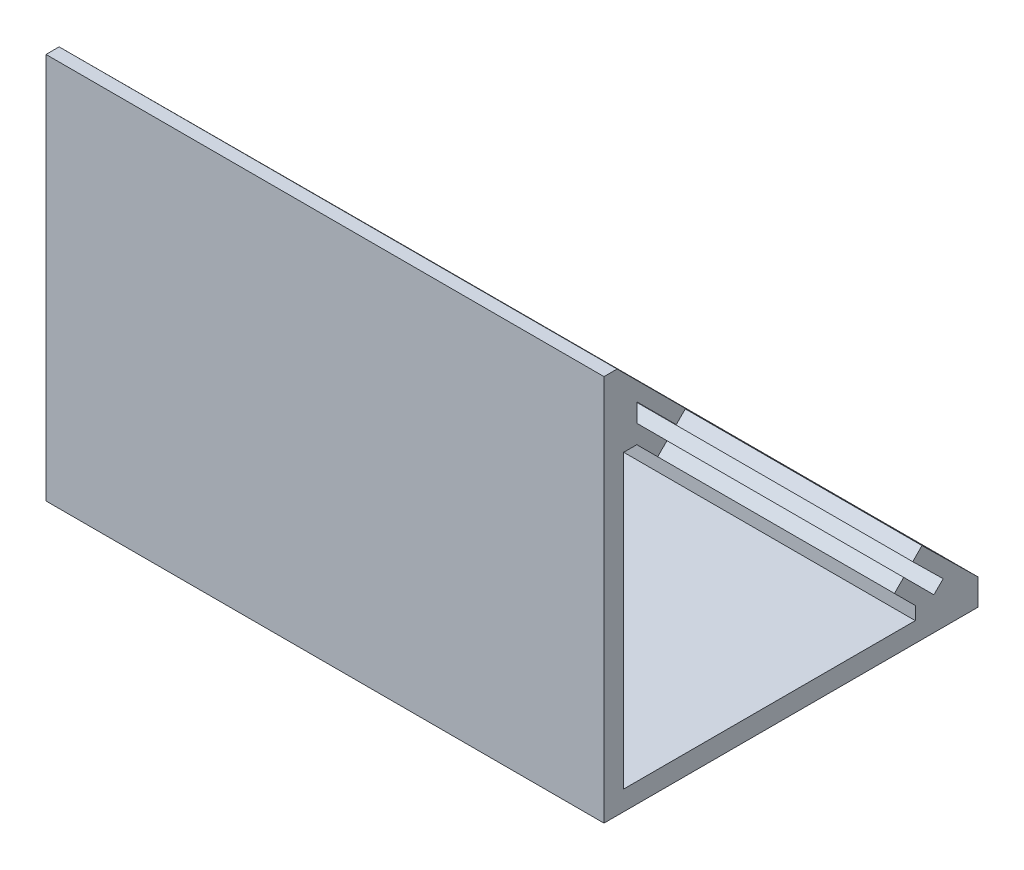
ISO-10303-21;
HEADER;
FILE_DESCRIPTION(('STEP AP214'),'2;1');
FILE_NAME('part.step','',(''),(''),'','','');
FILE_SCHEMA(('AUTOMOTIVE_DESIGN { 1 0 10303 214 1 1 1 1 }'));
ENDSEC;
DATA;
#1=APPLICATION_CONTEXT('core data for automotive mechanical design processes');
#2=APPLICATION_PROTOCOL_DEFINITION('international standard','automotive_design',2000,#1);
#3=PRODUCT_CONTEXT('',#1,'mechanical');
#4=PRODUCT('Part','Part','',(#3));
#5=PRODUCT_RELATED_PRODUCT_CATEGORY('part','',(#4));
#6=PRODUCT_DEFINITION_FORMATION('','',#4);
#7=PRODUCT_DEFINITION_CONTEXT('part definition',#1,'design');
#8=PRODUCT_DEFINITION('design','',#6,#7);
#9=PRODUCT_DEFINITION_SHAPE('','',#8);
#10=(LENGTH_UNIT() NAMED_UNIT(*) SI_UNIT(.MILLI.,.METRE.));
#11=(NAMED_UNIT(*) PLANE_ANGLE_UNIT() SI_UNIT($,.RADIAN.));
#12=(NAMED_UNIT(*) SI_UNIT($,.STERADIAN.) SOLID_ANGLE_UNIT());
#13=UNCERTAINTY_MEASURE_WITH_UNIT(LENGTH_MEASURE(1.E-05),#10,'distance_accuracy_value','');
#14=(GEOMETRIC_REPRESENTATION_CONTEXT(3) GLOBAL_UNCERTAINTY_ASSIGNED_CONTEXT((#13)) GLOBAL_UNIT_ASSIGNED_CONTEXT((#10,
#11,#12)) REPRESENTATION_CONTEXT('',''));
#15=CARTESIAN_POINT('',(0.,0.,0.));
#16=DIRECTION('',(0.,0.,1.));
#17=DIRECTION('',(1.,0.,0.));
#18=AXIS2_PLACEMENT_3D('',#15,#16,#17);
#19=CARTESIAN_POINT('',(-82.,45.2548339959385,0.));
#20=DIRECTION('',(0.,0.707106781186556,-0.707106781186539));
#21=DIRECTION('',(0.,0.707106781186539,0.707106781186556));
#22=AXIS2_PLACEMENT_3D('',#19,#20,#21);
#23=PLANE('',#22);
#24=DIRECTION('',(1.,0.,0.));
#25=VECTOR('',#24,1.);
#26=CARTESIAN_POINT('',(-82.,4.5961940777125,-40.658639918227));
#27=LINE('',#26,#25);
#28=CARTESIAN_POINT('',(-82.,4.5961940777125,-40.658639918227));
#29=VERTEX_POINT('',#28);
#30=CARTESIAN_POINT('',(0.,4.5961940777125,-40.658639918227));
#31=VERTEX_POINT('',#30);
#32=EDGE_CURVE('E465',#29,#31,#27,.T.);
#33=ORIENTED_EDGE('',*,*,#32,.T.);
#34=DIRECTION('',(0.,0.707106781186539,0.707106781186556));
#35=VECTOR('',#34,1.);
#36=CARTESIAN_POINT('',(0.,45.2548339959385,0.));
#37=LINE('',#36,#35);
#38=CARTESIAN_POINT('',(0.,0.,-45.2548339959396));
#39=VERTEX_POINT('',#38);
#40=EDGE_CURVE('E477',#39,#31,#37,.T.);
#41=ORIENTED_EDGE('',*,*,#40,.F.);
#42=DIRECTION('',(1.,0.,0.));
#43=VECTOR('',#42,1.);
#44=CARTESIAN_POINT('',(-82.,0.,-45.2548339959396));
#45=LINE('',#44,#43);
#46=CARTESIAN_POINT('',(-82.,0.,-45.2548339959396));
#47=VERTEX_POINT('',#46);
#48=EDGE_CURVE('E49',#47,#39,#45,.T.);
#49=ORIENTED_EDGE('',*,*,#48,.F.);
#50=DIRECTION('',(0.,0.707106781186539,0.707106781186556));
#51=VECTOR('',#50,1.);
#52=CARTESIAN_POINT('',(-82.,45.2548339959385,0.));
#53=LINE('',#52,#51);
#54=EDGE_CURVE('E472',#47,#29,#53,.T.);
#55=ORIENTED_EDGE('',*,*,#54,.T.);
#56=EDGE_LOOP('',(#33,#41,#49,#55));
#57=FACE_BOUND('',#56,.T.);
#58=ADVANCED_FACE('F39',(#57),#23,.T.);
#59=DIRECTION('',(1.,0.,0.));
#60=VECTOR('',#59,1.);
#61=CARTESIAN_POINT('',(-82.,40.658639918226,-4.59619407771263));
#62=LINE('',#61,#60);
#63=CARTESIAN_POINT('',(-82.,40.658639918226,-4.59619407771263));
#64=VERTEX_POINT('',#63);
#65=CARTESIAN_POINT('',(0.,40.658639918226,-4.59619407771263));
#66=VERTEX_POINT('',#65);
#67=EDGE_CURVE('E464',#64,#66,#62,.T.);
#68=ORIENTED_EDGE('',*,*,#67,.F.);
#69=CARTESIAN_POINT('',(-82.,45.2548339959385,0.));
#70=VERTEX_POINT('',#69);
#71=EDGE_CURVE('E476',#64,#70,#53,.T.);
#72=ORIENTED_EDGE('',*,*,#71,.T.);
#73=DIRECTION('',(1.,0.,0.));
#74=VECTOR('',#73,1.);
#75=CARTESIAN_POINT('',(-82.,45.2548339959385,0.));
#76=LINE('',#75,#74);
#77=CARTESIAN_POINT('',(0.,45.2548339959385,0.));
#78=VERTEX_POINT('',#77);
#79=EDGE_CURVE('E11',#70,#78,#76,.T.);
#80=ORIENTED_EDGE('',*,*,#79,.T.);
#81=EDGE_CURVE('E469',#66,#78,#37,.T.);
#82=ORIENTED_EDGE('',*,*,#81,.F.);
#83=EDGE_LOOP('',(#68,#72,#80,#82));
#84=FACE_BOUND('',#83,.T.);
#85=ADVANCED_FACE('F41',(#84),#23,.T.);
#86=CARTESIAN_POINT('',(0.,0.,0.));
#87=DIRECTION('',(1.,0.,0.));
#88=DIRECTION('',(0.,0.,-1.));
#89=AXIS2_PLACEMENT_3D('',#86,#87,#88);
#90=PLANE('',#89);
#91=DIRECTION('',(0.,1.,0.));
#92=VECTOR('',#91,1.);
#93=CARTESIAN_POINT('',(0.,-2.00000000000001,-42.4264068711934));
#94=LINE('',#93,#92);
#95=CARTESIAN_POINT('',(0.,-2.00000000000001,-42.4264068711934));
#96=VERTEX_POINT('',#95);
#97=CARTESIAN_POINT('',(0.,0.,-42.4264068711934));
#98=VERTEX_POINT('',#97);
#99=EDGE_CURVE('E208',#96,#98,#94,.T.);
#100=ORIENTED_EDGE('',*,*,#99,.F.);
#101=DIRECTION('',(0.,0.,-1.));
#102=VECTOR('',#101,1.);
#103=CARTESIAN_POINT('',(0.,-2.,2.));
#104=LINE('',#103,#102);
#105=CARTESIAN_POINT('',(0.,-2.,2.));
#106=VERTEX_POINT('',#105);
#107=EDGE_CURVE('E209',#106,#96,#104,.T.);
#108=ORIENTED_EDGE('',*,*,#107,.F.);
#109=DIRECTION('',(0.,-1.,0.));
#110=VECTOR('',#109,1.);
#111=CARTESIAN_POINT('',(0.,42.4264068711924,2.));
#112=LINE('',#111,#110);
#113=CARTESIAN_POINT('',(0.,42.4264068711924,2.));
#114=VERTEX_POINT('',#113);
#115=EDGE_CURVE('E241',#114,#106,#112,.T.);
#116=ORIENTED_EDGE('',*,*,#115,.F.);
#117=DIRECTION('',(0.,0.,-1.));
#118=VECTOR('',#117,1.);
#119=CARTESIAN_POINT('',(0.,42.4264068711924,2.));
#120=LINE('',#119,#118);
#121=CARTESIAN_POINT('',(0.,42.4264068711924,0.));
#122=VERTEX_POINT('',#121);
#123=EDGE_CURVE('E245',#114,#122,#120,.T.);
#124=ORIENTED_EDGE('',*,*,#123,.T.);
#125=DIRECTION('',(0.,0.707106781186547,0.707106781186548));
#126=VECTOR('',#125,1.);
#127=CARTESIAN_POINT('',(0.,41.5425233947091,-0.883883476483219));
#128=LINE('',#127,#126);
#129=CARTESIAN_POINT('',(0.,39.2444263558528,-3.18198051533952));
#130=VERTEX_POINT('',#129);
#131=EDGE_CURVE('E514',#130,#122,#128,.T.);
#132=ORIENTED_EDGE('',*,*,#131,.F.);
#133=DIRECTION('',(0.,-0.707106781186553,0.707106781186543));
#134=VECTOR('',#133,1.);
#135=CARTESIAN_POINT('',(0.,40.658639918226,-4.59619407771263));
#136=LINE('',#135,#134);
#137=EDGE_CURVE('E57',#66,#130,#136,.T.);
#138=ORIENTED_EDGE('',*,*,#137,.F.);
#139=ORIENTED_EDGE('',*,*,#81,.T.);
#140=DIRECTION('',(0.,1.,0.));
#141=VECTOR('',#140,1.);
#142=CARTESIAN_POINT('',(0.,45.2548339959385,0.));
#143=LINE('',#142,#141);
#144=CARTESIAN_POINT('',(0.,48.0832611206847,0.));
#145=VERTEX_POINT('',#144);
#146=EDGE_CURVE('E414',#78,#145,#143,.T.);
#147=ORIENTED_EDGE('',*,*,#146,.T.);
#148=DIRECTION('',(0.,-0.707106781186547,-0.707106781186548));
#149=VECTOR('',#148,1.);
#150=CARTESIAN_POINT('',(0.,46.6690475583116,-1.4142135623731));
#151=LINE('',#150,#149);
#152=CARTESIAN_POINT('',(0.,42.072853480599,-6.01040764008567));
#153=VERTEX_POINT('',#152);
#154=EDGE_CURVE('E417',#145,#153,#151,.T.);
#155=ORIENTED_EDGE('',*,*,#154,.T.);
#156=DIRECTION('',(0.,0.707106781186549,-0.707106781186546));
#157=VECTOR('',#156,1.);
#158=CARTESIAN_POINT('',(0.,42.072853480599,-6.01040764008567));
#159=LINE('',#158,#157);
#160=CARTESIAN_POINT('',(0.,43.4870670429721,-7.42462120245876));
#161=VERTEX_POINT('',#160);
#162=EDGE_CURVE('E422',#153,#161,#159,.T.);
#163=ORIENTED_EDGE('',*,*,#162,.T.);
#164=DIRECTION('',(0.,0.707106781186546,0.707106781186549));
#165=VECTOR('',#164,1.);
#166=CARTESIAN_POINT('',(0.,43.4870670429721,-7.42462120245876));
#167=LINE('',#166,#165);
#168=CARTESIAN_POINT('',(0.,53.9116882454308,3.));
#169=VERTEX_POINT('',#168);
#170=EDGE_CURVE('E426',#161,#169,#167,.T.);
#171=ORIENTED_EDGE('',*,*,#170,.T.);
#172=DIRECTION('',(0.,0.,-1.));
#173=VECTOR('',#172,1.);
#174=CARTESIAN_POINT('',(0.,53.9116882454308,5.));
#175=LINE('',#174,#173);
#176=CARTESIAN_POINT('',(0.,53.9116882454308,5.));
#177=VERTEX_POINT('',#176);
#178=EDGE_CURVE('E270',#177,#169,#175,.T.);
#179=ORIENTED_EDGE('',*,*,#178,.F.);
#180=DIRECTION('',(0.,1.,0.));
#181=VECTOR('',#180,1.);
#182=CARTESIAN_POINT('',(0.,-4.99999999999944,5.));
#183=LINE('',#182,#181);
#184=CARTESIAN_POINT('',(0.,-4.99999999999944,5.));
#185=VERTEX_POINT('',#184);
#186=EDGE_CURVE('E249',#185,#177,#183,.T.);
#187=ORIENTED_EDGE('',*,*,#186,.F.);
#188=DIRECTION('',(0.,0.,1.));
#189=VECTOR('',#188,1.);
#190=CARTESIAN_POINT('',(0.,-5.00000000000002,-51.9742599730551));
#191=LINE('',#190,#189);
#192=CARTESIAN_POINT('',(0.,-5.00000000000002,-51.9742599730551));
#193=VERTEX_POINT('',#192);
#194=EDGE_CURVE('E273',#193,#185,#191,.T.);
#195=ORIENTED_EDGE('',*,*,#194,.F.);
#196=DIRECTION('',(0.,1.,0.));
#197=VECTOR('',#196,1.);
#198=CARTESIAN_POINT('',(0.,-3.00000000000002,-51.9742599730552));
#199=LINE('',#198,#197);
#200=CARTESIAN_POINT('',(0.,-1.00000000000002,-51.9742599730552));
#201=VERTEX_POINT('',#200);
#202=EDGE_CURVE('E418',#193,#201,#199,.T.);
#203=ORIENTED_EDGE('',*,*,#202,.T.);
#204=DIRECTION('',(0.,0.701360665091504,0.712806577875375));
#205=VECTOR('',#204,1.);
#206=CARTESIAN_POINT('',(0.,7.39882036087168,-43.4383743758184));
#207=LINE('',#206,#205);
#208=CARTESIAN_POINT('',(0.,7.39882036087168,-43.4383743758184));
#209=VERTEX_POINT('',#208);
#210=EDGE_CURVE('E430',#201,#209,#207,.T.);
#211=ORIENTED_EDGE('',*,*,#210,.T.);
#212=DIRECTION('',(0.,-0.712806577875375,0.701360665091504));
#213=VECTOR('',#212,1.);
#214=CARTESIAN_POINT('',(0.,5.97320720512093,-42.0356530456354));
#215=LINE('',#214,#213);
#216=CARTESIAN_POINT('',(0.,5.97320720512093,-42.0356530456354));
#217=VERTEX_POINT('',#216);
#218=EDGE_CURVE('E434',#209,#217,#215,.T.);
#219=ORIENTED_EDGE('',*,*,#218,.T.);
#220=DIRECTION('',(0.,-0.701360665091504,-0.712806577875375));
#221=VECTOR('',#220,1.);
#222=CARTESIAN_POINT('',(0.,1.41421356237309,-46.6690475583127));
#223=LINE('',#222,#221);
#224=CARTESIAN_POINT('',(0.,1.41421356237309,-46.6690475583127));
#225=VERTEX_POINT('',#224);
#226=EDGE_CURVE('E438',#217,#225,#223,.T.);
#227=ORIENTED_EDGE('',*,*,#226,.T.);
#228=DIRECTION('',(0.,-0.707106781186547,0.707106781186548));
#229=VECTOR('',#228,1.);
#230=CARTESIAN_POINT('',(0.,0.,-45.2548339959396));
#231=LINE('',#230,#229);
#232=EDGE_CURVE('E442',#225,#39,#231,.T.);
#233=ORIENTED_EDGE('',*,*,#232,.T.);
#234=ORIENTED_EDGE('',*,*,#40,.T.);
#235=DIRECTION('',(0.,0.707106781186548,-0.707106781186547));
#236=VECTOR('',#235,1.);
#237=CARTESIAN_POINT('',(0.,4.5961940777125,-40.658639918227));
#238=LINE('',#237,#236);
#239=CARTESIAN_POINT('',(0.,3.18198051533895,-39.2444263558534));
#240=VERTEX_POINT('',#239);
#241=EDGE_CURVE('E490',#240,#31,#238,.T.);
#242=ORIENTED_EDGE('',*,*,#241,.F.);
#243=DIRECTION('',(0.,0.707106781186547,0.707106781186547));
#244=VECTOR('',#243,1.);
#245=CARTESIAN_POINT('',(0.,0.883883476483157,-41.5425233947102));
#246=LINE('',#245,#244);
#247=EDGE_CURVE('E511',#98,#240,#246,.T.);
#248=ORIENTED_EDGE('',*,*,#247,.F.);
#249=EDGE_LOOP('',(#100,#108,#116,#124,#132,#138,#139,#147,#155,#163,#171,#179,#187,#195,#203,
#211,#219,#227,#233,#234,#242,#248));
#250=FACE_BOUND('',#249,.T.);
#251=ADVANCED_FACE('F343',(#250),#90,.T.);
#252=CARTESIAN_POINT('',(-159.701111739463,0.,-45.2548339959396));
#253=DIRECTION('',(0.,0.707106781186548,0.707106781186547));
#254=DIRECTION('',(0.,-0.707106781186547,0.707106781186548));
#255=AXIS2_PLACEMENT_3D('',#252,#253,#254);
#256=PLANE('',#255);
#257=DIRECTION('',(0.,0.707106781186547,-0.707106781186548));
#258=VECTOR('',#257,1.);
#259=CARTESIAN_POINT('',(-82.,0.,-45.2548339959396));
#260=LINE('',#259,#258);
#261=CARTESIAN_POINT('',(-82.,1.41421356237309,-46.6690475583127));
#262=VERTEX_POINT('',#261);
#263=EDGE_CURVE('E409',#47,#262,#260,.T.);
#264=ORIENTED_EDGE('',*,*,#263,.F.);
#265=ORIENTED_EDGE('',*,*,#48,.T.);
#266=ORIENTED_EDGE('',*,*,#232,.F.);
#267=DIRECTION('',(1.,0.,0.));
#268=VECTOR('',#267,1.);
#269=CARTESIAN_POINT('',(-159.701111739463,1.41421356237309,-46.6690475583127));
#270=LINE('',#269,#268);
#271=EDGE_CURVE('E447',#262,#225,#270,.T.);
#272=ORIENTED_EDGE('',*,*,#271,.F.);
#273=EDGE_LOOP('',(#264,#265,#266,#272));
#274=FACE_BOUND('',#273,.T.);
#275=ADVANCED_FACE('F339',(#274),#256,.T.);
#276=CARTESIAN_POINT('',(-159.701111739463,1.41421356237309,-46.6690475583127));
#277=DIRECTION('',(0.,-0.712806577875375,0.701360665091504));
#278=DIRECTION('',(0.,-0.701360665091504,-0.712806577875375));
#279=AXIS2_PLACEMENT_3D('',#276,#277,#278);
#280=PLANE('',#279);
#281=DIRECTION('',(0.,0.701360665091504,0.712806577875375));
#282=VECTOR('',#281,1.);
#283=CARTESIAN_POINT('',(-82.,1.41421356237309,-46.6690475583127));
#284=LINE('',#283,#282);
#285=CARTESIAN_POINT('',(-82.,5.97320720512093,-42.0356530456354));
#286=VERTEX_POINT('',#285);
#287=EDGE_CURVE('E405',#262,#286,#284,.T.);
#288=ORIENTED_EDGE('',*,*,#287,.F.);
#289=ORIENTED_EDGE('',*,*,#271,.T.);
#290=ORIENTED_EDGE('',*,*,#226,.F.);
#291=DIRECTION('',(1.,0.,0.));
#292=VECTOR('',#291,1.);
#293=CARTESIAN_POINT('',(-159.701111739463,5.97320720512093,-42.0356530456354));
#294=LINE('',#293,#292);
#295=EDGE_CURVE('E450',#286,#217,#294,.T.);
#296=ORIENTED_EDGE('',*,*,#295,.F.);
#297=EDGE_LOOP('',(#288,#289,#290,#296));
#298=FACE_BOUND('',#297,.T.);
#299=ADVANCED_FACE('F342',(#298),#280,.T.);
#300=CARTESIAN_POINT('',(-159.701111739463,5.97320720512093,-42.0356530456354));
#301=DIRECTION('',(0.,0.701360665091504,0.712806577875375));
#302=DIRECTION('',(0.,-0.712806577875375,0.701360665091504));
#303=AXIS2_PLACEMENT_3D('',#300,#301,#302);
#304=PLANE('',#303);
#305=DIRECTION('',(0.,0.712806577875375,-0.701360665091504));
#306=VECTOR('',#305,1.);
#307=CARTESIAN_POINT('',(-82.,5.97320720512093,-42.0356530456354));
#308=LINE('',#307,#306);
#309=CARTESIAN_POINT('',(-82.,7.39882036087168,-43.4383743758184));
#310=VERTEX_POINT('',#309);
#311=EDGE_CURVE('E398',#286,#310,#308,.T.);
#312=ORIENTED_EDGE('',*,*,#311,.F.);
#313=ORIENTED_EDGE('',*,*,#295,.T.);
#314=ORIENTED_EDGE('',*,*,#218,.F.);
#315=DIRECTION('',(1.,0.,0.));
#316=VECTOR('',#315,1.);
#317=CARTESIAN_POINT('',(-159.701111739463,7.39882036087168,-43.4383743758184));
#318=LINE('',#317,#316);
#319=EDGE_CURVE('E453',#310,#209,#318,.T.);
#320=ORIENTED_EDGE('',*,*,#319,.F.);
#321=EDGE_LOOP('',(#312,#313,#314,#320));
#322=FACE_BOUND('',#321,.T.);
#323=ADVANCED_FACE('F347',(#322),#304,.T.);
#324=CARTESIAN_POINT('',(-159.701111739463,7.39882036087168,-43.4383743758184));
#325=DIRECTION('',(0.,0.712806577875375,-0.701360665091504));
#326=DIRECTION('',(0.,0.701360665091504,0.712806577875375));
#327=AXIS2_PLACEMENT_3D('',#324,#325,#326);
#328=PLANE('',#327);
#329=DIRECTION('',(0.,-0.701360665091504,-0.712806577875375));
#330=VECTOR('',#329,1.);
#331=CARTESIAN_POINT('',(-82.,7.39882036087168,-43.4383743758184));
#332=LINE('',#331,#330);
#333=CARTESIAN_POINT('',(-82.,-1.00000000000002,-51.9742599730552));
#334=VERTEX_POINT('',#333);
#335=EDGE_CURVE('E394',#310,#334,#332,.T.);
#336=ORIENTED_EDGE('',*,*,#335,.F.);
#337=ORIENTED_EDGE('',*,*,#319,.T.);
#338=ORIENTED_EDGE('',*,*,#210,.F.);
#339=DIRECTION('',(1.,0.,0.));
#340=VECTOR('',#339,1.);
#341=CARTESIAN_POINT('',(-159.701111739463,-1.00000000000002,-51.9742599730552));
#342=LINE('',#341,#340);
#343=EDGE_CURVE('E378',#334,#201,#342,.T.);
#344=ORIENTED_EDGE('',*,*,#343,.F.);
#345=EDGE_LOOP('',(#336,#337,#338,#344));
#346=FACE_BOUND('',#345,.T.);
#347=ADVANCED_FACE('F351',(#346),#328,.T.);
#348=CARTESIAN_POINT('',(-159.701111739463,43.4870670429721,-7.42462120245876));
#349=DIRECTION('',(0.,0.707106781186549,-0.707106781186546));
#350=DIRECTION('',(0.,0.707106781186546,0.707106781186549));
#351=AXIS2_PLACEMENT_3D('',#348,#349,#350);
#352=PLANE('',#351);
#353=CARTESIAN_POINT('',(-82.,53.9116882454308,3.));
#354=DIRECTION('',(0.,-0.706704022840158,-0.707509310257849));
#355=VECTOR('',#354,1.);
#356=LINE('',#353,#355);
#357=CARTESIAN_POINT('',(-82.,53.9116882454308,3.));
#358=VERTEX_POINT('',#357);
#359=CARTESIAN_POINT('',(-82.,43.4900367483131,-7.4275875276798));
#360=VERTEX_POINT('',#359);
#361=EDGE_CURVE('E298',#358,#360,#356,.T.);
#362=ORIENTED_EDGE('',*,*,#361,.F.);
#363=DIRECTION('',(1.,0.,0.));
#364=VECTOR('',#363,1.);
#365=CARTESIAN_POINT('',(-159.701111739463,53.9116882454308,3.));
#366=LINE('',#365,#364);
#367=EDGE_CURVE('E369',#358,#169,#366,.T.);
#368=ORIENTED_EDGE('',*,*,#367,.T.);
#369=ORIENTED_EDGE('',*,*,#170,.F.);
#370=DIRECTION('',(1.,0.,0.));
#371=VECTOR('',#370,1.);
#372=CARTESIAN_POINT('',(-159.701111739463,43.4870670429721,-7.42462120245876));
#373=LINE('',#372,#371);
#374=EDGE_CURVE('E379',#360,#161,#373,.T.);
#375=ORIENTED_EDGE('',*,*,#374,.F.);
#376=EDGE_LOOP('',(#362,#368,#369,#375));
#377=FACE_BOUND('',#376,.T.);
#378=ADVANCED_FACE('F355',(#377),#352,.T.);
#379=CARTESIAN_POINT('',(-159.701111739463,42.072853480599,-6.01040764008567));
#380=DIRECTION('',(0.,-0.707106781186546,-0.707106781186549));
#381=DIRECTION('',(0.,0.707106781186549,-0.707106781186546));
#382=AXIS2_PLACEMENT_3D('',#379,#380,#381);
#383=PLANE('',#382);
#384=DIRECTION('',(0.,-0.707106781186549,0.707106781186546));
#385=VECTOR('',#384,1.);
#386=CARTESIAN_POINT('',(-82.,42.072853480599,-6.01040764008567));
#387=LINE('',#386,#385);
#388=CARTESIAN_POINT('',(-82.,42.072853480599,-6.01040764008567));
#389=VERTEX_POINT('',#388);
#390=EDGE_CURVE('E382',#360,#389,#387,.T.);
#391=ORIENTED_EDGE('',*,*,#390,.F.);
#392=ORIENTED_EDGE('',*,*,#374,.T.);
#393=ORIENTED_EDGE('',*,*,#162,.F.);
#394=DIRECTION('',(1.,0.,0.));
#395=VECTOR('',#394,1.);
#396=CARTESIAN_POINT('',(-159.701111739463,42.072853480599,-6.01040764008567));
#397=LINE('',#396,#395);
#398=EDGE_CURVE('E391',#389,#153,#397,.T.);
#399=ORIENTED_EDGE('',*,*,#398,.F.);
#400=EDGE_LOOP('',(#391,#392,#393,#399));
#401=FACE_BOUND('',#400,.T.);
#402=ADVANCED_FACE('F360',(#401),#383,.T.);
#403=CARTESIAN_POINT('',(-159.701111739463,46.6690475583116,-1.4142135623731));
#404=DIRECTION('',(0.,-0.707106781186548,0.707106781186547));
#405=DIRECTION('',(0.,-0.707106781186547,-0.707106781186548));
#406=AXIS2_PLACEMENT_3D('',#403,#404,#405);
#407=PLANE('',#406);
#408=DIRECTION('',(0.,0.707106781186547,0.707106781186548));
#409=VECTOR('',#408,1.);
#410=CARTESIAN_POINT('',(-82.,46.6690475583116,-1.4142135623731));
#411=LINE('',#410,#409);
#412=CARTESIAN_POINT('',(-82.,48.0832611206847,0.));
#413=VERTEX_POINT('',#412);
#414=EDGE_CURVE('E386',#389,#413,#411,.T.);
#415=ORIENTED_EDGE('',*,*,#414,.F.);
#416=ORIENTED_EDGE('',*,*,#398,.T.);
#417=ORIENTED_EDGE('',*,*,#154,.F.);
#418=DIRECTION('',(1.,0.,0.));
#419=VECTOR('',#418,1.);
#420=CARTESIAN_POINT('',(-159.701111739463,48.0832611206847,0.));
#421=LINE('',#420,#419);
#422=EDGE_CURVE('E446',#413,#145,#421,.T.);
#423=ORIENTED_EDGE('',*,*,#422,.F.);
#424=EDGE_LOOP('',(#415,#416,#417,#423));
#425=FACE_BOUND('',#424,.T.);
#426=ADVANCED_FACE('F574',(#425),#407,.T.);
#427=CARTESIAN_POINT('',(-159.701111739463,45.2548339959385,0.));
#428=DIRECTION('',(0.,0.,-1.));
#429=DIRECTION('',(0.,1.,0.));
#430=AXIS2_PLACEMENT_3D('',#427,#428,#429);
#431=PLANE('',#430);
#432=ORIENTED_EDGE('',*,*,#146,.F.);
#433=ORIENTED_EDGE('',*,*,#79,.F.);
#434=DIRECTION('',(0.,-1.,0.));
#435=VECTOR('',#434,1.);
#436=CARTESIAN_POINT('',(-82.,45.2548339959385,0.));
#437=LINE('',#436,#435);
#438=EDGE_CURVE('E413',#413,#70,#437,.T.);
#439=ORIENTED_EDGE('',*,*,#438,.F.);
#440=ORIENTED_EDGE('',*,*,#422,.T.);
#441=EDGE_LOOP('',(#432,#433,#439,#440));
#442=FACE_BOUND('',#441,.T.);
#443=ADVANCED_FACE('F337',(#442),#431,.T.);
#444=CARTESIAN_POINT('',(-82.,-3.00000000000002,-51.9742599730552));
#445=DIRECTION('',(0.,0.,1.));
#446=DIRECTION('',(0.,-1.,0.));
#447=AXIS2_PLACEMENT_3D('',#444,#445,#446);
#448=PLANE('',#447);
#449=ORIENTED_EDGE('',*,*,#343,.T.);
#450=ORIENTED_EDGE('',*,*,#202,.F.);
#451=DIRECTION('',(1.,0.,0.));
#452=VECTOR('',#451,1.);
#453=CARTESIAN_POINT('',(-85.,-5.00000000000002,-51.9742599730551));
#454=LINE('',#453,#452);
#455=CARTESIAN_POINT('',(-85.,-5.00000000000002,-51.9742599730551));
#456=VERTEX_POINT('',#455);
#457=EDGE_CURVE('E280',#456,#193,#454,.T.);
#458=ORIENTED_EDGE('',*,*,#457,.F.);
#459=DIRECTION('',(0.,-1.,0.));
#460=VECTOR('',#459,1.);
#461=CARTESIAN_POINT('',(-85.,-1.00000000000002,-51.9742599730552));
#462=LINE('',#461,#460);
#463=CARTESIAN_POINT('',(-85.,-1.00000000000002,-51.9742599730552));
#464=VERTEX_POINT('',#463);
#465=EDGE_CURVE('E288',#464,#456,#462,.T.);
#466=ORIENTED_EDGE('',*,*,#465,.F.);
#467=DIRECTION('',(1.,0.,0.));
#468=VECTOR('',#467,1.);
#469=CARTESIAN_POINT('',(-84.,-1.00000000000002,-51.9742599730552));
#470=LINE('',#469,#468);
#471=EDGE_CURVE('E500',#464,#334,#470,.T.);
#472=ORIENTED_EDGE('',*,*,#471,.T.);
#473=EDGE_LOOP('',(#449,#450,#458,#466,#472));
#474=FACE_BOUND('',#473,.T.);
#475=ADVANCED_FACE('F330',(#474),#448,.F.);
#476=CARTESIAN_POINT('',(-142.,41.5425233947091,-0.883883476483219));
#477=DIRECTION('',(0.,0.707106781186548,-0.707106781186547));
#478=DIRECTION('',(0.,0.707106781186547,0.707106781186548));
#479=AXIS2_PLACEMENT_3D('',#476,#477,#478);
#480=PLANE('',#479);
#481=DIRECTION('',(0.,-0.707106781186547,-0.707106781186548));
#482=VECTOR('',#481,1.);
#483=CARTESIAN_POINT('',(-82.,41.5425233947091,-0.883883476483219));
#484=LINE('',#483,#482);
#485=CARTESIAN_POINT('',(-82.,42.4264068711924,0.));
#486=VERTEX_POINT('',#485);
#487=CARTESIAN_POINT('',(-82.,39.2444263558529,-3.18198051533952));
#488=VERTEX_POINT('',#487);
#489=EDGE_CURVE('E507',#486,#488,#484,.T.);
#490=ORIENTED_EDGE('',*,*,#489,.T.);
#491=DIRECTION('',(1.,0.,0.));
#492=VECTOR('',#491,1.);
#493=CARTESIAN_POINT('',(-85.1622776601686,39.2444263558529,-3.18198051533952));
#494=LINE('',#493,#492);
#495=EDGE_CURVE('E534',#488,#130,#494,.T.);
#496=ORIENTED_EDGE('',*,*,#495,.T.);
#497=ORIENTED_EDGE('',*,*,#131,.T.);
#498=DIRECTION('',(1.,0.,0.));
#499=VECTOR('',#498,1.);
#500=CARTESIAN_POINT('',(-142.,42.4264068711924,0.));
#501=LINE('',#500,#499);
#502=EDGE_CURVE('E519',#486,#122,#501,.T.);
#503=ORIENTED_EDGE('',*,*,#502,.F.);
#504=EDGE_LOOP('',(#490,#496,#497,#503));
#505=FACE_BOUND('',#504,.T.);
#506=ADVANCED_FACE('F327',(#505),#480,.F.);
#507=CARTESIAN_POINT('',(-142.,0.883883476483157,-41.5425233947102));
#508=DIRECTION('',(0.,0.707106781186547,-0.707106781186547));
#509=DIRECTION('',(0.,0.707106781186548,0.707106781186548));
#510=AXIS2_PLACEMENT_3D('',#507,#508,#509);
#511=PLANE('',#510);
#512=ORIENTED_EDGE('',*,*,#247,.T.);
#513=DIRECTION('',(1.,0.,0.));
#514=VECTOR('',#513,1.);
#515=CARTESIAN_POINT('',(-85.1622776601686,3.18198051533895,-39.2444263558534));
#516=LINE('',#515,#514);
#517=CARTESIAN_POINT('',(-82.,3.18198051533894,-39.2444263558544));
#518=VERTEX_POINT('',#517);
#519=EDGE_CURVE('E491',#518,#240,#516,.T.);
#520=ORIENTED_EDGE('',*,*,#519,.F.);
#521=DIRECTION('',(0.,-0.707106781186548,-0.707106781186548));
#522=VECTOR('',#521,1.);
#523=CARTESIAN_POINT('',(-82.,0.883883476483157,-41.5425233947102));
#524=LINE('',#523,#522);
#525=CARTESIAN_POINT('',(-82.,0.,-42.4264068711934));
#526=VERTEX_POINT('',#525);
#527=EDGE_CURVE('E504',#518,#526,#524,.T.);
#528=ORIENTED_EDGE('',*,*,#527,.T.);
#529=DIRECTION('',(1.,0.,0.));
#530=VECTOR('',#529,1.);
#531=CARTESIAN_POINT('',(-142.,0.,-42.4264068711934));
#532=LINE('',#531,#530);
#533=EDGE_CURVE('E203',#526,#98,#532,.T.);
#534=ORIENTED_EDGE('',*,*,#533,.T.);
#535=EDGE_LOOP('',(#512,#520,#528,#534));
#536=FACE_BOUND('',#535,.T.);
#537=ADVANCED_FACE('F326',(#536),#511,.F.);
#538=CARTESIAN_POINT('',(-85.1622776601686,4.5961940777125,-40.658639918227));
#539=DIRECTION('',(0.,-0.707106781186547,-0.707106781186548));
#540=DIRECTION('',(0.,0.707106781186548,-0.707106781186547));
#541=AXIS2_PLACEMENT_3D('',#538,#539,#540);
#542=PLANE('',#541);
#543=DIRECTION('',(0.,-0.707106781186548,0.707106781186547));
#544=VECTOR('',#543,1.);
#545=CARTESIAN_POINT('',(-82.,4.5961940777125,-40.658639918227));
#546=LINE('',#545,#544);
#547=EDGE_CURVE('E65',#29,#518,#546,.T.);
#548=ORIENTED_EDGE('',*,*,#547,.T.);
#549=ORIENTED_EDGE('',*,*,#519,.T.);
#550=ORIENTED_EDGE('',*,*,#241,.T.);
#551=ORIENTED_EDGE('',*,*,#32,.F.);
#552=EDGE_LOOP('',(#548,#549,#550,#551));
#553=FACE_BOUND('',#552,.T.);
#554=ADVANCED_FACE('F323',(#553),#542,.F.);
#555=CARTESIAN_POINT('',(-85.1622776601686,40.658639918226,-4.59619407771263));
#556=DIRECTION('',(0.,0.707106781186542,0.707106781186553));
#557=DIRECTION('',(0.,-0.707106781186553,0.707106781186542));
#558=AXIS2_PLACEMENT_3D('',#555,#556,#557);
#559=PLANE('',#558);
#560=DIRECTION('',(0.,0.707106781186553,-0.707106781186542));
#561=VECTOR('',#560,1.);
#562=CARTESIAN_POINT('',(-82.,40.658639918226,-4.59619407771263));
#563=LINE('',#562,#561);
#564=EDGE_CURVE('E515',#488,#64,#563,.T.);
#565=ORIENTED_EDGE('',*,*,#564,.T.);
#566=ORIENTED_EDGE('',*,*,#67,.T.);
#567=ORIENTED_EDGE('',*,*,#137,.T.);
#568=ORIENTED_EDGE('',*,*,#495,.F.);
#569=EDGE_LOOP('',(#565,#566,#567,#568));
#570=FACE_BOUND('',#569,.T.);
#571=ADVANCED_FACE('F320',(#570),#559,.F.);
#572=CARTESIAN_POINT('',(-82.,0.,0.));
#573=DIRECTION('',(-1.,0.,0.));
#574=DIRECTION('',(0.,0.,1.));
#575=AXIS2_PLACEMENT_3D('',#572,#573,#574);
#576=PLANE('',#575);
#577=ORIENTED_EDGE('',*,*,#311,.T.);
#578=ORIENTED_EDGE('',*,*,#335,.T.);
#579=CARTESIAN_POINT('',(-82.,43.4930064536541,-7.43055385290083));
#580=DIRECTION('',(0.,-0.706704022840158,-0.707509310257849));
#581=VECTOR('',#580,1.);
#582=LINE('',#579,#581);
#583=EDGE_CURVE('E291',#360,#334,#582,.T.);
#584=ORIENTED_EDGE('',*,*,#583,.F.);
#585=ORIENTED_EDGE('',*,*,#390,.T.);
#586=ORIENTED_EDGE('',*,*,#414,.T.);
#587=ORIENTED_EDGE('',*,*,#438,.T.);
#588=ORIENTED_EDGE('',*,*,#71,.F.);
#589=ORIENTED_EDGE('',*,*,#564,.F.);
#590=ORIENTED_EDGE('',*,*,#489,.F.);
#591=DIRECTION('',(0.,0.,-1.));
#592=VECTOR('',#591,1.);
#593=CARTESIAN_POINT('',(-82.,42.4264068711924,2.));
#594=LINE('',#593,#592);
#595=CARTESIAN_POINT('',(-82.,42.4264068711924,2.));
#596=VERTEX_POINT('',#595);
#597=EDGE_CURVE('E244',#596,#486,#594,.T.);
#598=ORIENTED_EDGE('',*,*,#597,.F.);
#599=DIRECTION('',(0.,1.,0.));
#600=VECTOR('',#599,1.);
#601=CARTESIAN_POINT('',(-82.,0.,2.));
#602=LINE('',#601,#600);
#603=CARTESIAN_POINT('',(-82.,-2.,2.));
#604=VERTEX_POINT('',#603);
#605=EDGE_CURVE('E216',#604,#596,#602,.T.);
#606=ORIENTED_EDGE('',*,*,#605,.F.);
#607=DIRECTION('',(0.,0.,1.));
#608=VECTOR('',#607,1.);
#609=CARTESIAN_POINT('',(-82.,-2.00000000000001,-42.4264068711934));
#610=LINE('',#609,#608);
#611=CARTESIAN_POINT('',(-82.,-2.00000000000001,-42.4264068711934));
#612=VERTEX_POINT('',#611);
#613=EDGE_CURVE('E212',#612,#604,#610,.T.);
#614=ORIENTED_EDGE('',*,*,#613,.F.);
#615=DIRECTION('',(0.,1.,0.));
#616=VECTOR('',#615,1.);
#617=CARTESIAN_POINT('',(-82.,-2.00000000000001,-42.4264068711934));
#618=LINE('',#617,#616);
#619=EDGE_CURVE('E196',#612,#526,#618,.T.);
#620=ORIENTED_EDGE('',*,*,#619,.T.);
#621=ORIENTED_EDGE('',*,*,#527,.F.);
#622=ORIENTED_EDGE('',*,*,#547,.F.);
#623=ORIENTED_EDGE('',*,*,#54,.F.);
#624=ORIENTED_EDGE('',*,*,#263,.T.);
#625=ORIENTED_EDGE('',*,*,#287,.T.);
#626=EDGE_LOOP('',(#577,#578,#584,#585,#586,#587,#588,#589,#590,#598,#606,#614,#620,#621,#622,
#623,#624,#625));
#627=FACE_BOUND('',#626,.T.);
#628=ADVANCED_FACE('F214',(#627),#576,.F.);
#629=CARTESIAN_POINT('',(-84.,53.9116882454308,3.));
#630=DIRECTION('',(0.,-0.707509310257849,0.706704022840158));
#631=DIRECTION('',(0.,-0.706704022840158,-0.707509310257849));
#632=AXIS2_PLACEMENT_3D('',#629,#630,#631);
#633=PLANE('',#632);
#634=ORIENTED_EDGE('',*,*,#361,.T.);
#635=ORIENTED_EDGE('',*,*,#583,.T.);
#636=ORIENTED_EDGE('',*,*,#471,.F.);
#637=DIRECTION('',(0.,-0.706704022840158,-0.707509310257849));
#638=VECTOR('',#637,1.);
#639=CARTESIAN_POINT('',(-85.,53.9116882454308,3.));
#640=LINE('',#639,#638);
#641=CARTESIAN_POINT('',(-85.,53.9116882454308,3.));
#642=VERTEX_POINT('',#641);
#643=EDGE_CURVE('E284',#642,#464,#640,.T.);
#644=ORIENTED_EDGE('',*,*,#643,.F.);
#645=DIRECTION('',(1.,0.,0.));
#646=VECTOR('',#645,1.);
#647=CARTESIAN_POINT('',(-84.,53.9116882454308,3.));
#648=LINE('',#647,#646);
#649=EDGE_CURVE('E495',#642,#358,#648,.T.);
#650=ORIENTED_EDGE('',*,*,#649,.T.);
#651=EDGE_LOOP('',(#634,#635,#636,#644,#650));
#652=FACE_BOUND('',#651,.T.);
#653=ADVANCED_FACE('F308',(#652),#633,.F.);
#654=CARTESIAN_POINT('',(-85.,0.,0.));
#655=DIRECTION('',(-1.,0.,0.));
#656=DIRECTION('',(0.,0.,1.));
#657=AXIS2_PLACEMENT_3D('',#654,#655,#656);
#658=PLANE('',#657);
#659=ORIENTED_EDGE('',*,*,#643,.T.);
#660=ORIENTED_EDGE('',*,*,#465,.T.);
#661=DIRECTION('',(0.,0.,-1.));
#662=VECTOR('',#661,1.);
#663=CARTESIAN_POINT('',(-85.,-4.99999999999944,3.00000000000004));
#664=LINE('',#663,#662);
#665=CARTESIAN_POINT('',(-85.,-4.99999999999944,5.));
#666=VERTEX_POINT('',#665);
#667=EDGE_CURVE('E276',#666,#456,#664,.T.);
#668=ORIENTED_EDGE('',*,*,#667,.F.);
#669=DIRECTION('',(0.,-1.,0.));
#670=VECTOR('',#669,1.);
#671=CARTESIAN_POINT('',(-85.,53.9116882454308,5.));
#672=LINE('',#671,#670);
#673=CARTESIAN_POINT('',(-85.,53.9116882454308,5.));
#674=VERTEX_POINT('',#673);
#675=EDGE_CURVE('E258',#674,#666,#672,.T.);
#676=ORIENTED_EDGE('',*,*,#675,.F.);
#677=DIRECTION('',(0.,0.,-1.));
#678=VECTOR('',#677,1.);
#679=CARTESIAN_POINT('',(-85.,53.9116882454308,5.));
#680=LINE('',#679,#678);
#681=EDGE_CURVE('E266',#674,#642,#680,.T.);
#682=ORIENTED_EDGE('',*,*,#681,.T.);
#683=EDGE_LOOP('',(#659,#660,#668,#676,#682));
#684=FACE_BOUND('',#683,.T.);
#685=ADVANCED_FACE('F317',(#684),#658,.T.);
#686=CARTESIAN_POINT('',(0.,-4.99999999999948,0.));
#687=DIRECTION('',(0.,-1.,0.));
#688=DIRECTION('',(0.,0.,-1.));
#689=AXIS2_PLACEMENT_3D('',#686,#687,#688);
#690=PLANE('',#689);
#691=ORIENTED_EDGE('',*,*,#194,.T.);
#692=DIRECTION('',(1.,0.,0.));
#693=VECTOR('',#692,1.);
#694=CARTESIAN_POINT('',(-85.,-4.99999999999944,5.));
#695=LINE('',#694,#693);
#696=EDGE_CURVE('E262',#666,#185,#695,.T.);
#697=ORIENTED_EDGE('',*,*,#696,.F.);
#698=ORIENTED_EDGE('',*,*,#667,.T.);
#699=ORIENTED_EDGE('',*,*,#457,.T.);
#700=EDGE_LOOP('',(#691,#697,#698,#699));
#701=FACE_BOUND('',#700,.T.);
#702=ADVANCED_FACE('F744',(#701),#690,.T.);
#703=CARTESIAN_POINT('',(-82.,53.9116882454308,5.));
#704=DIRECTION('',(0.,-1.,0.));
#705=DIRECTION('',(0.,0.,-1.));
#706=AXIS2_PLACEMENT_3D('',#703,#704,#705);
#707=PLANE('',#706);
#708=ORIENTED_EDGE('',*,*,#367,.F.);
#709=ORIENTED_EDGE('',*,*,#649,.F.);
#710=ORIENTED_EDGE('',*,*,#681,.F.);
#711=DIRECTION('',(-1.,0.,0.));
#712=VECTOR('',#711,1.);
#713=CARTESIAN_POINT('',(0.,53.9116882454308,5.));
#714=LINE('',#713,#712);
#715=EDGE_CURVE('E255',#177,#674,#714,.T.);
#716=ORIENTED_EDGE('',*,*,#715,.F.);
#717=ORIENTED_EDGE('',*,*,#178,.T.);
#718=EDGE_LOOP('',(#708,#709,#710,#716,#717));
#719=FACE_BOUND('',#718,.T.);
#720=ADVANCED_FACE('F755',(#719),#707,.F.);
#721=CARTESIAN_POINT('',(0.,0.,5.));
#722=DIRECTION('',(0.,0.,1.));
#723=DIRECTION('',(1.,0.,0.));
#724=AXIS2_PLACEMENT_3D('',#721,#722,#723);
#725=PLANE('',#724);
#726=ORIENTED_EDGE('',*,*,#186,.T.);
#727=ORIENTED_EDGE('',*,*,#715,.T.);
#728=ORIENTED_EDGE('',*,*,#675,.T.);
#729=ORIENTED_EDGE('',*,*,#696,.T.);
#730=EDGE_LOOP('',(#726,#727,#728,#729));
#731=FACE_BOUND('',#730,.T.);
#732=ADVANCED_FACE('F591',(#731),#725,.T.);
#733=CARTESIAN_POINT('',(-82.,42.4264068711924,2.));
#734=DIRECTION('',(0.,1.,0.));
#735=DIRECTION('',(0.,0.,1.));
#736=AXIS2_PLACEMENT_3D('',#733,#734,#735);
#737=PLANE('',#736);
#738=ORIENTED_EDGE('',*,*,#502,.T.);
#739=ORIENTED_EDGE('',*,*,#123,.F.);
#740=DIRECTION('',(1.,0.,0.));
#741=VECTOR('',#740,1.);
#742=CARTESIAN_POINT('',(-82.,42.4264068711924,2.));
#743=LINE('',#742,#741);
#744=EDGE_CURVE('E237',#596,#114,#743,.T.);
#745=ORIENTED_EDGE('',*,*,#744,.F.);
#746=ORIENTED_EDGE('',*,*,#597,.T.);
#747=EDGE_LOOP('',(#738,#739,#745,#746));
#748=FACE_BOUND('',#747,.T.);
#749=ADVANCED_FACE('F581',(#748),#737,.F.);
#750=CARTESIAN_POINT('',(0.,0.,2.));
#751=DIRECTION('',(0.,0.,-1.));
#752=DIRECTION('',(-1.,0.,0.));
#753=AXIS2_PLACEMENT_3D('',#750,#751,#752);
#754=PLANE('',#753);
#755=ORIENTED_EDGE('',*,*,#115,.T.);
#756=DIRECTION('',(1.,0.,0.));
#757=VECTOR('',#756,1.);
#758=CARTESIAN_POINT('',(-82.,-2.,2.));
#759=LINE('',#758,#757);
#760=EDGE_CURVE('E221',#604,#106,#759,.T.);
#761=ORIENTED_EDGE('',*,*,#760,.F.);
#762=ORIENTED_EDGE('',*,*,#605,.T.);
#763=ORIENTED_EDGE('',*,*,#744,.T.);
#764=EDGE_LOOP('',(#755,#761,#762,#763));
#765=FACE_BOUND('',#764,.T.);
#766=ADVANCED_FACE('F583',(#765),#754,.T.);
#767=CARTESIAN_POINT('',(0.,-2.00000000000001,-42.4264068711934));
#768=DIRECTION('',(0.,0.,-1.));
#769=DIRECTION('',(0.,1.,0.));
#770=AXIS2_PLACEMENT_3D('',#767,#768,#769);
#771=PLANE('',#770);
#772=ORIENTED_EDGE('',*,*,#533,.F.);
#773=ORIENTED_EDGE('',*,*,#619,.F.);
#774=DIRECTION('',(-1.,0.,0.));
#775=VECTOR('',#774,1.);
#776=CARTESIAN_POINT('',(0.,-2.00000000000001,-42.4264068711934));
#777=LINE('',#776,#775);
#778=EDGE_CURVE('E200',#96,#612,#777,.T.);
#779=ORIENTED_EDGE('',*,*,#778,.F.);
#780=ORIENTED_EDGE('',*,*,#99,.T.);
#781=EDGE_LOOP('',(#772,#773,#779,#780));
#782=FACE_BOUND('',#781,.T.);
#783=ADVANCED_FACE('F198',(#782),#771,.F.);
#784=CARTESIAN_POINT('',(0.,-2.,0.));
#785=DIRECTION('',(0.,1.,0.));
#786=DIRECTION('',(0.,0.,1.));
#787=AXIS2_PLACEMENT_3D('',#784,#785,#786);
#788=PLANE('',#787);
#789=ORIENTED_EDGE('',*,*,#778,.T.);
#790=ORIENTED_EDGE('',*,*,#613,.T.);
#791=ORIENTED_EDGE('',*,*,#760,.T.);
#792=ORIENTED_EDGE('',*,*,#107,.T.);
#793=EDGE_LOOP('',(#789,#790,#791,#792));
#794=FACE_BOUND('',#793,.T.);
#795=ADVANCED_FACE('F223',(#794),#788,.T.);
#796=CLOSED_SHELL('',(#58,#85,#251,#275,#299,#323,#347,#378,#402,#426,#443,#475,#506,#537,#554,
#571,#628,#653,#685,#702,#720,#732,#749,#766,#783,#795));
#797=MANIFOLD_SOLID_BREP('B2',#796);
#798=ADVANCED_BREP_SHAPE_REPRESENTATION('',(#18,#797),#14);
#799=SHAPE_DEFINITION_REPRESENTATION(#9,#798);
ENDSEC;
END-ISO-10303-21;
